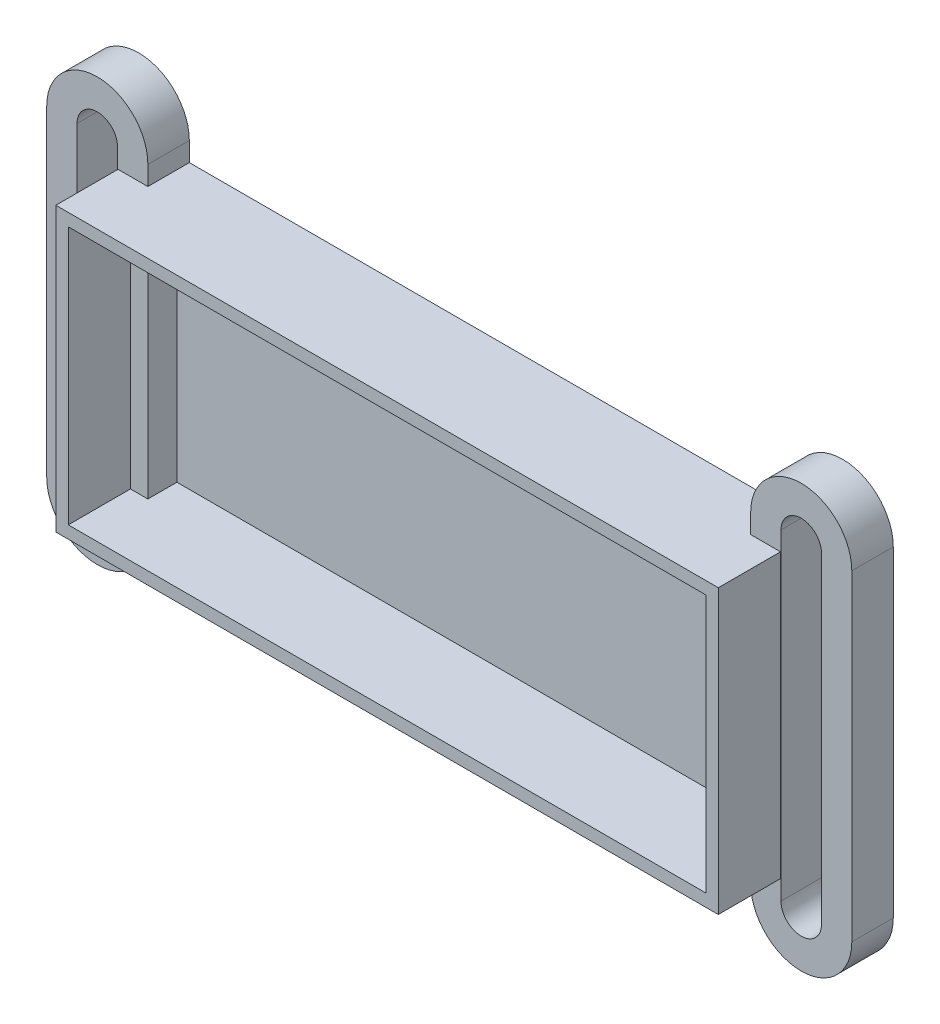
ISO-10303-21;
HEADER;
FILE_DESCRIPTION(('STEP AP214'),'2;1');
FILE_NAME('part.step','',(''),(''),'','','');
FILE_SCHEMA(('AUTOMOTIVE_DESIGN { 1 0 10303 214 1 1 1 1 }'));
ENDSEC;
DATA;
#1=APPLICATION_CONTEXT('core data for automotive mechanical design processes');
#2=APPLICATION_PROTOCOL_DEFINITION('international standard','automotive_design',2000,#1);
#3=PRODUCT_CONTEXT('',#1,'mechanical');
#4=PRODUCT('Part','Part','',(#3));
#5=PRODUCT_RELATED_PRODUCT_CATEGORY('part','',(#4));
#6=PRODUCT_DEFINITION_FORMATION('','',#4);
#7=PRODUCT_DEFINITION_CONTEXT('part definition',#1,'design');
#8=PRODUCT_DEFINITION('design','',#6,#7);
#9=PRODUCT_DEFINITION_SHAPE('','',#8);
#10=(LENGTH_UNIT() NAMED_UNIT(*) SI_UNIT(.MILLI.,.METRE.));
#11=(NAMED_UNIT(*) PLANE_ANGLE_UNIT() SI_UNIT($,.RADIAN.));
#12=(NAMED_UNIT(*) SI_UNIT($,.STERADIAN.) SOLID_ANGLE_UNIT());
#13=UNCERTAINTY_MEASURE_WITH_UNIT(LENGTH_MEASURE(1.E-05),#10,'distance_accuracy_value','');
#14=(GEOMETRIC_REPRESENTATION_CONTEXT(3) GLOBAL_UNCERTAINTY_ASSIGNED_CONTEXT((#13)) GLOBAL_UNIT_ASSIGNED_CONTEXT((#10,
#11,#12)) REPRESENTATION_CONTEXT('',''));
#15=CARTESIAN_POINT('',(0.,0.,0.));
#16=DIRECTION('',(0.,0.,1.));
#17=DIRECTION('',(1.,0.,0.));
#18=AXIS2_PLACEMENT_3D('',#15,#16,#17);
#19=CARTESIAN_POINT('',(-40.4302838924313,18.8073356452537,0.));
#20=DIRECTION('',(0.,1.,0.));
#21=DIRECTION('',(-1.,0.,0.));
#22=AXIS2_PLACEMENT_3D('',#19,#20,#21);
#23=PLANE('',#22);
#24=DIRECTION('',(0.,0.,-1.));
#25=VECTOR('',#24,1.);
#26=CARTESIAN_POINT('',(19.392541216514,18.8073356452537,0.));
#27=LINE('',#26,#25);
#28=CARTESIAN_POINT('',(19.392541216514,18.8073356452537,4.));
#29=VERTEX_POINT('',#28);
#30=CARTESIAN_POINT('',(19.392541216514,18.8073356452537,1.2));
#31=VERTEX_POINT('',#30);
#32=EDGE_CURVE('E62',#29,#31,#27,.T.);
#33=ORIENTED_EDGE('',*,*,#32,.F.);
#34=DIRECTION('',(-1.,0.,0.));
#35=VECTOR('',#34,1.);
#36=CARTESIAN_POINT('',(-40.4302838924313,18.8073356452537,4.));
#37=LINE('',#36,#35);
#38=CARTESIAN_POINT('',(21.0697161075687,18.8073356452537,4.));
#39=VERTEX_POINT('',#38);
#40=EDGE_CURVE('E66',#39,#29,#37,.T.);
#41=ORIENTED_EDGE('',*,*,#40,.F.);
#42=DIRECTION('',(0.,0.,1.));
#43=VECTOR('',#42,1.);
#44=CARTESIAN_POINT('',(21.0697161075687,18.8073356452537,0.));
#45=LINE('',#44,#43);
#46=CARTESIAN_POINT('',(21.0697161075687,18.8073356452537,10.));
#47=VERTEX_POINT('',#46);
#48=EDGE_CURVE('E47',#39,#47,#45,.T.);
#49=ORIENTED_EDGE('',*,*,#48,.T.);
#50=DIRECTION('',(-1.,0.,0.));
#51=VECTOR('',#50,1.);
#52=CARTESIAN_POINT('',(-40.4302838924313,18.8073356452537,10.));
#53=LINE('',#52,#51);
#54=CARTESIAN_POINT('',(-40.4302838924313,18.8073356452537,10.));
#55=VERTEX_POINT('',#54);
#56=EDGE_CURVE('E480',#47,#55,#53,.T.);
#57=ORIENTED_EDGE('',*,*,#56,.T.);
#58=DIRECTION('',(0.,0.,1.));
#59=VECTOR('',#58,1.);
#60=CARTESIAN_POINT('',(-40.4302838924313,18.8073356452537,0.));
#61=LINE('',#60,#59);
#62=CARTESIAN_POINT('',(-40.4302838924313,18.8073356452537,4.));
#63=VERTEX_POINT('',#62);
#64=EDGE_CURVE('E486',#63,#55,#61,.T.);
#65=ORIENTED_EDGE('',*,*,#64,.F.);
#66=DIRECTION('',(-1.,0.,0.));
#67=VECTOR('',#66,1.);
#68=CARTESIAN_POINT('',(-40.4302838924313,18.8073356452537,4.));
#69=LINE('',#68,#67);
#70=CARTESIAN_POINT('',(-38.7531090013766,18.8073356452537,4.));
#71=VERTEX_POINT('',#70);
#72=EDGE_CURVE('E471',#71,#63,#69,.T.);
#73=ORIENTED_EDGE('',*,*,#72,.F.);
#74=DIRECTION('',(0.,0.,-1.));
#75=VECTOR('',#74,1.);
#76=CARTESIAN_POINT('',(-38.7531090013766,18.8073356452537,0.));
#77=LINE('',#76,#75);
#78=CARTESIAN_POINT('',(-38.7531090013766,18.8073356452537,1.2));
#79=VERTEX_POINT('',#78);
#80=EDGE_CURVE('E447',#71,#79,#77,.T.);
#81=ORIENTED_EDGE('',*,*,#80,.T.);
#82=DIRECTION('',(-1.,0.,0.));
#83=VECTOR('',#82,1.);
#84=CARTESIAN_POINT('',(-40.4302838924313,18.8073356452537,1.2));
#85=LINE('',#84,#83);
#86=EDGE_CURVE('E477',#31,#79,#85,.T.);
#87=ORIENTED_EDGE('',*,*,#86,.F.);
#88=EDGE_LOOP('',(#33,#41,#49,#57,#65,#73,#81,#87));
#89=FACE_BOUND('',#88,.T.);
#90=ADVANCED_FACE('F43',(#89),#23,.F.);
#91=CARTESIAN_POINT('',(21.0697161075687,18.8073356452537,0.));
#92=DIRECTION('',(1.,0.,0.));
#93=DIRECTION('',(0.,0.,-1.));
#94=AXIS2_PLACEMENT_3D('',#91,#92,#93);
#95=PLANE('',#94);
#96=DIRECTION('',(0.,1.,0.));
#97=VECTOR('',#96,1.);
#98=CARTESIAN_POINT('',(21.0697161075687,18.8073356452537,4.));
#99=LINE('',#98,#97);
#100=CARTESIAN_POINT('',(21.0697161075687,-6.09266435474631,4.));
#101=VERTEX_POINT('',#100);
#102=EDGE_CURVE('E349',#101,#39,#99,.T.);
#103=ORIENTED_EDGE('',*,*,#102,.F.);
#104=DIRECTION('',(0.,0.,1.));
#105=VECTOR('',#104,1.);
#106=CARTESIAN_POINT('',(21.0697161075687,-6.09266435474631,0.));
#107=LINE('',#106,#105);
#108=CARTESIAN_POINT('',(21.0697161075687,-6.09266435474631,10.));
#109=VERTEX_POINT('',#108);
#110=EDGE_CURVE('E531',#101,#109,#107,.T.);
#111=ORIENTED_EDGE('',*,*,#110,.T.);
#112=DIRECTION('',(0.,1.,0.));
#113=VECTOR('',#112,1.);
#114=CARTESIAN_POINT('',(21.0697161075687,18.8073356452537,10.));
#115=LINE('',#114,#113);
#116=EDGE_CURVE('E490',#109,#47,#115,.T.);
#117=ORIENTED_EDGE('',*,*,#116,.T.);
#118=ORIENTED_EDGE('',*,*,#48,.F.);
#119=EDGE_LOOP('',(#103,#111,#117,#118));
#120=FACE_BOUND('',#119,.T.);
#121=ADVANCED_FACE('F655',(#120),#95,.F.);
#122=CARTESIAN_POINT('',(-40.4302838924313,-6.09266435474631,0.));
#123=DIRECTION('',(0.,-1.,0.));
#124=DIRECTION('',(0.,0.,-1.));
#125=AXIS2_PLACEMENT_3D('',#122,#123,#124);
#126=PLANE('',#125);
#127=DIRECTION('',(0.,0.,1.));
#128=VECTOR('',#127,1.);
#129=CARTESIAN_POINT('',(19.392541216514,-6.09266435474631,0.));
#130=LINE('',#129,#128);
#131=CARTESIAN_POINT('',(19.392541216514,-6.09266435474631,1.2));
#132=VERTEX_POINT('',#131);
#133=CARTESIAN_POINT('',(19.392541216514,-6.09266435474631,4.));
#134=VERTEX_POINT('',#133);
#135=EDGE_CURVE('E310',#132,#134,#130,.T.);
#136=ORIENTED_EDGE('',*,*,#135,.F.);
#137=DIRECTION('',(1.,0.,0.));
#138=VECTOR('',#137,1.);
#139=CARTESIAN_POINT('',(-40.4302838924313,-6.09266435474631,1.2));
#140=LINE('',#139,#138);
#141=CARTESIAN_POINT('',(-38.7531090013766,-6.09266435474631,1.2));
#142=VERTEX_POINT('',#141);
#143=EDGE_CURVE('E474',#142,#132,#140,.T.);
#144=ORIENTED_EDGE('',*,*,#143,.F.);
#145=DIRECTION('',(0.,0.,1.));
#146=VECTOR('',#145,1.);
#147=CARTESIAN_POINT('',(-38.7531090013766,-6.09266435474631,0.));
#148=LINE('',#147,#146);
#149=CARTESIAN_POINT('',(-38.7531090013766,-6.09266435474631,4.));
#150=VERTEX_POINT('',#149);
#151=EDGE_CURVE('E420',#142,#150,#148,.T.);
#152=ORIENTED_EDGE('',*,*,#151,.T.);
#153=DIRECTION('',(1.,0.,0.));
#154=VECTOR('',#153,1.);
#155=CARTESIAN_POINT('',(-40.4302838924313,-6.09266435474631,4.));
#156=LINE('',#155,#154);
#157=CARTESIAN_POINT('',(-40.4302838924313,-6.09266435474631,4.));
#158=VERTEX_POINT('',#157);
#159=EDGE_CURVE('E468',#158,#150,#156,.T.);
#160=ORIENTED_EDGE('',*,*,#159,.F.);
#161=DIRECTION('',(0.,0.,1.));
#162=VECTOR('',#161,1.);
#163=CARTESIAN_POINT('',(-40.4302838924313,-6.09266435474631,0.));
#164=LINE('',#163,#162);
#165=CARTESIAN_POINT('',(-40.4302838924313,-6.09266435474631,10.));
#166=VERTEX_POINT('',#165);
#167=EDGE_CURVE('E494',#158,#166,#164,.T.);
#168=ORIENTED_EDGE('',*,*,#167,.T.);
#169=DIRECTION('',(1.,0.,0.));
#170=VECTOR('',#169,1.);
#171=CARTESIAN_POINT('',(-40.4302838924313,-6.09266435474631,10.));
#172=LINE('',#171,#170);
#173=EDGE_CURVE('E498',#166,#109,#172,.T.);
#174=ORIENTED_EDGE('',*,*,#173,.T.);
#175=ORIENTED_EDGE('',*,*,#110,.F.);
#176=DIRECTION('',(1.,0.,0.));
#177=VECTOR('',#176,1.);
#178=CARTESIAN_POINT('',(-40.4302838924313,-6.09266435474631,4.));
#179=LINE('',#178,#177);
#180=EDGE_CURVE('E345',#134,#101,#179,.T.);
#181=ORIENTED_EDGE('',*,*,#180,.F.);
#182=EDGE_LOOP('',(#136,#144,#152,#160,#168,#174,#175,#181));
#183=FACE_BOUND('',#182,.T.);
#184=ADVANCED_FACE('F660',(#183),#126,.F.);
#185=CARTESIAN_POINT('',(-41.6302838924313,20.0073356452537,0.));
#186=DIRECTION('',(0.,1.,0.));
#187=DIRECTION('',(0.,0.,1.));
#188=AXIS2_PLACEMENT_3D('',#185,#186,#187);
#189=PLANE('',#188);
#190=DIRECTION('',(-1.,0.,0.));
#191=VECTOR('',#190,1.);
#192=CARTESIAN_POINT('',(-41.6302838924313,20.0073356452537,4.));
#193=LINE('',#192,#191);
#194=CARTESIAN_POINT('',(22.2697161075687,20.0073356452537,4.));
#195=VERTEX_POINT('',#194);
#196=CARTESIAN_POINT('',(19.392541216514,20.0073356452537,4.));
#197=VERTEX_POINT('',#196);
#198=EDGE_CURVE('E342',#195,#197,#193,.T.);
#199=ORIENTED_EDGE('',*,*,#198,.T.);
#200=DIRECTION('',(0.,0.,-1.));
#201=VECTOR('',#200,1.);
#202=CARTESIAN_POINT('',(19.392541216514,20.0073356452537,0.));
#203=LINE('',#202,#201);
#204=CARTESIAN_POINT('',(19.392541216514,20.0073356452537,0.));
#205=VERTEX_POINT('',#204);
#206=EDGE_CURVE('E281',#197,#205,#203,.T.);
#207=ORIENTED_EDGE('',*,*,#206,.T.);
#208=DIRECTION('',(-1.,0.,0.));
#209=VECTOR('',#208,1.);
#210=CARTESIAN_POINT('',(-41.6302838924313,20.0073356452537,0.));
#211=LINE('',#210,#209);
#212=CARTESIAN_POINT('',(-38.7531090013766,20.0073356452537,0.));
#213=VERTEX_POINT('',#212);
#214=EDGE_CURVE('E527',#205,#213,#211,.T.);
#215=ORIENTED_EDGE('',*,*,#214,.T.);
#216=DIRECTION('',(0.,0.,-1.));
#217=VECTOR('',#216,1.);
#218=CARTESIAN_POINT('',(-38.7531090013766,20.0073356452537,0.));
#219=LINE('',#218,#217);
#220=CARTESIAN_POINT('',(-38.7531090013766,20.0073356452537,4.));
#221=VERTEX_POINT('',#220);
#222=EDGE_CURVE('E455',#221,#213,#219,.T.);
#223=ORIENTED_EDGE('',*,*,#222,.F.);
#224=DIRECTION('',(-1.,0.,0.));
#225=VECTOR('',#224,1.);
#226=CARTESIAN_POINT('',(-41.6302838924313,20.0073356452537,4.));
#227=LINE('',#226,#225);
#228=CARTESIAN_POINT('',(-41.6302838924313,20.0073356452537,4.));
#229=VERTEX_POINT('',#228);
#230=EDGE_CURVE('E462',#221,#229,#227,.T.);
#231=ORIENTED_EDGE('',*,*,#230,.T.);
#232=DIRECTION('',(0.,0.,1.));
#233=VECTOR('',#232,1.);
#234=CARTESIAN_POINT('',(-41.6302838924313,20.0073356452537,0.));
#235=LINE('',#234,#233);
#236=CARTESIAN_POINT('',(-41.6302838924313,20.0073356452537,10.));
#237=VERTEX_POINT('',#236);
#238=EDGE_CURVE('E517',#229,#237,#235,.T.);
#239=ORIENTED_EDGE('',*,*,#238,.T.);
#240=DIRECTION('',(-1.,0.,0.));
#241=VECTOR('',#240,1.);
#242=CARTESIAN_POINT('',(-41.6302838924313,20.0073356452537,10.));
#243=LINE('',#242,#241);
#244=CARTESIAN_POINT('',(22.2697161075687,20.0073356452537,10.));
#245=VERTEX_POINT('',#244);
#246=EDGE_CURVE('E528',#245,#237,#243,.T.);
#247=ORIENTED_EDGE('',*,*,#246,.F.);
#248=DIRECTION('',(0.,0.,1.));
#249=VECTOR('',#248,1.);
#250=CARTESIAN_POINT('',(22.2697161075687,20.0073356452537,0.));
#251=LINE('',#250,#249);
#252=EDGE_CURVE('E524',#195,#245,#251,.T.);
#253=ORIENTED_EDGE('',*,*,#252,.F.);
#254=EDGE_LOOP('',(#199,#207,#215,#223,#231,#239,#247,#253));
#255=FACE_BOUND('',#254,.T.);
#256=ADVANCED_FACE('F578',(#255),#189,.T.);
#257=CARTESIAN_POINT('',(22.2697161075687,20.0073356452537,0.));
#258=DIRECTION('',(1.,0.,0.));
#259=DIRECTION('',(0.,0.,-1.));
#260=AXIS2_PLACEMENT_3D('',#257,#258,#259);
#261=PLANE('',#260);
#262=DIRECTION('',(0.,0.,1.));
#263=VECTOR('',#262,1.);
#264=CARTESIAN_POINT('',(22.2697161075687,-7.29266435474631,0.));
#265=LINE('',#264,#263);
#266=CARTESIAN_POINT('',(22.2697161075687,-7.29266435474631,4.));
#267=VERTEX_POINT('',#266);
#268=CARTESIAN_POINT('',(22.2697161075687,-7.29266435474631,10.));
#269=VERTEX_POINT('',#268);
#270=EDGE_CURVE('E503',#267,#269,#265,.T.);
#271=ORIENTED_EDGE('',*,*,#270,.F.);
#272=DIRECTION('',(0.,1.,0.));
#273=VECTOR('',#272,1.);
#274=CARTESIAN_POINT('',(22.2697161075687,20.0073356452537,4.));
#275=LINE('',#274,#273);
#276=EDGE_CURVE('E339',#267,#195,#275,.T.);
#277=ORIENTED_EDGE('',*,*,#276,.T.);
#278=ORIENTED_EDGE('',*,*,#252,.T.);
#279=DIRECTION('',(0.,1.,0.));
#280=VECTOR('',#279,1.);
#281=CARTESIAN_POINT('',(22.2697161075687,20.0073356452537,10.));
#282=LINE('',#281,#280);
#283=EDGE_CURVE('E507',#269,#245,#282,.T.);
#284=ORIENTED_EDGE('',*,*,#283,.F.);
#285=EDGE_LOOP('',(#271,#277,#278,#284));
#286=FACE_BOUND('',#285,.T.);
#287=ADVANCED_FACE('F574',(#286),#261,.T.);
#288=CARTESIAN_POINT('',(-41.6302838924313,-7.29266435474631,0.));
#289=DIRECTION('',(0.,-1.,0.));
#290=DIRECTION('',(0.,0.,-1.));
#291=AXIS2_PLACEMENT_3D('',#288,#289,#290);
#292=PLANE('',#291);
#293=DIRECTION('',(1.,0.,0.));
#294=VECTOR('',#293,1.);
#295=CARTESIAN_POINT('',(-41.6302838924313,-7.29266435474631,0.));
#296=LINE('',#295,#294);
#297=CARTESIAN_POINT('',(-38.7531090013766,-7.29266435474631,0.));
#298=VERTEX_POINT('',#297);
#299=CARTESIAN_POINT('',(19.392541216514,-7.29266435474631,0.));
#300=VERTEX_POINT('',#299);
#301=EDGE_CURVE('E491',#298,#300,#296,.T.);
#302=ORIENTED_EDGE('',*,*,#301,.T.);
#303=DIRECTION('',(0.,0.,1.));
#304=VECTOR('',#303,1.);
#305=CARTESIAN_POINT('',(19.392541216514,-7.29266435474631,0.));
#306=LINE('',#305,#304);
#307=CARTESIAN_POINT('',(19.392541216514,-7.29266435474631,4.));
#308=VERTEX_POINT('',#307);
#309=EDGE_CURVE('E334',#300,#308,#306,.T.);
#310=ORIENTED_EDGE('',*,*,#309,.T.);
#311=DIRECTION('',(1.,0.,0.));
#312=VECTOR('',#311,1.);
#313=CARTESIAN_POINT('',(-41.6302838924313,-7.29266435474631,4.));
#314=LINE('',#313,#312);
#315=EDGE_CURVE('E12',#308,#267,#314,.T.);
#316=ORIENTED_EDGE('',*,*,#315,.T.);
#317=ORIENTED_EDGE('',*,*,#270,.T.);
#318=DIRECTION('',(1.,0.,0.));
#319=VECTOR('',#318,1.);
#320=CARTESIAN_POINT('',(-41.6302838924313,-7.29266435474631,10.));
#321=LINE('',#320,#319);
#322=CARTESIAN_POINT('',(-41.6302838924313,-7.29266435474631,10.));
#323=VERTEX_POINT('',#322);
#324=EDGE_CURVE('E506',#323,#269,#321,.T.);
#325=ORIENTED_EDGE('',*,*,#324,.F.);
#326=DIRECTION('',(0.,0.,1.));
#327=VECTOR('',#326,1.);
#328=CARTESIAN_POINT('',(-41.6302838924313,-7.29266435474631,0.));
#329=LINE('',#328,#327);
#330=CARTESIAN_POINT('',(-41.6302838924313,-7.29266435474631,4.));
#331=VERTEX_POINT('',#330);
#332=EDGE_CURVE('E540',#331,#323,#329,.T.);
#333=ORIENTED_EDGE('',*,*,#332,.F.);
#334=DIRECTION('',(1.,0.,0.));
#335=VECTOR('',#334,1.);
#336=CARTESIAN_POINT('',(-41.6302838924313,-7.29266435474631,4.));
#337=LINE('',#336,#335);
#338=CARTESIAN_POINT('',(-38.7531090013766,-7.29266435474631,4.));
#339=VERTEX_POINT('',#338);
#340=EDGE_CURVE('E459',#331,#339,#337,.T.);
#341=ORIENTED_EDGE('',*,*,#340,.T.);
#342=DIRECTION('',(0.,0.,1.));
#343=VECTOR('',#342,1.);
#344=CARTESIAN_POINT('',(-38.7531090013766,-7.29266435474631,0.));
#345=LINE('',#344,#343);
#346=EDGE_CURVE('E451',#298,#339,#345,.T.);
#347=ORIENTED_EDGE('',*,*,#346,.F.);
#348=EDGE_LOOP('',(#302,#310,#316,#317,#325,#333,#341,#347));
#349=FACE_BOUND('',#348,.T.);
#350=ADVANCED_FACE('F679',(#349),#292,.T.);
#351=CARTESIAN_POINT('',(0.,0.,1.2));
#352=DIRECTION('',(0.,0.,-1.));
#353=DIRECTION('',(-1.,0.,0.));
#354=AXIS2_PLACEMENT_3D('',#351,#352,#353);
#355=PLANE('',#354);
#356=DIRECTION('',(0.,-1.,0.));
#357=VECTOR('',#356,1.);
#358=CARTESIAN_POINT('',(19.392541216514,0.,1.2));
#359=LINE('',#358,#357);
#360=EDGE_CURVE('E54',#31,#132,#359,.T.);
#361=ORIENTED_EDGE('',*,*,#360,.F.);
#362=ORIENTED_EDGE('',*,*,#86,.T.);
#363=DIRECTION('',(0.,-1.,0.));
#364=VECTOR('',#363,1.);
#365=CARTESIAN_POINT('',(-38.7531090013766,0.,1.2));
#366=LINE('',#365,#364);
#367=EDGE_CURVE('E522',#79,#142,#366,.T.);
#368=ORIENTED_EDGE('',*,*,#367,.T.);
#369=ORIENTED_EDGE('',*,*,#143,.T.);
#370=EDGE_LOOP('',(#361,#362,#368,#369));
#371=FACE_BOUND('',#370,.T.);
#372=ADVANCED_FACE('F664',(#371),#355,.F.);
#373=CARTESIAN_POINT('',(-40.4302838924313,18.8073356452537,0.));
#374=DIRECTION('',(-1.,0.,0.));
#375=DIRECTION('',(0.,0.,1.));
#376=AXIS2_PLACEMENT_3D('',#373,#374,#375);
#377=PLANE('',#376);
#378=DIRECTION('',(0.,-1.,0.));
#379=VECTOR('',#378,1.);
#380=CARTESIAN_POINT('',(-40.4302838924313,18.8073356452537,4.));
#381=LINE('',#380,#379);
#382=EDGE_CURVE('E465',#63,#158,#381,.T.);
#383=ORIENTED_EDGE('',*,*,#382,.F.);
#384=ORIENTED_EDGE('',*,*,#64,.T.);
#385=DIRECTION('',(0.,-1.,0.));
#386=VECTOR('',#385,1.);
#387=CARTESIAN_POINT('',(-40.4302838924313,18.8073356452537,10.));
#388=LINE('',#387,#386);
#389=EDGE_CURVE('E497',#55,#166,#388,.T.);
#390=ORIENTED_EDGE('',*,*,#389,.T.);
#391=ORIENTED_EDGE('',*,*,#167,.F.);
#392=EDGE_LOOP('',(#383,#384,#390,#391));
#393=FACE_BOUND('',#392,.T.);
#394=ADVANCED_FACE('F670',(#393),#377,.F.);
#395=CARTESIAN_POINT('',(-41.6302838924313,20.0073356452537,0.));
#396=DIRECTION('',(-1.,0.,0.));
#397=DIRECTION('',(0.,0.,1.));
#398=AXIS2_PLACEMENT_3D('',#395,#396,#397);
#399=PLANE('',#398);
#400=ORIENTED_EDGE('',*,*,#238,.F.);
#401=DIRECTION('',(0.,-1.,0.));
#402=VECTOR('',#401,1.);
#403=CARTESIAN_POINT('',(-41.6302838924313,20.0073356452537,4.));
#404=LINE('',#403,#402);
#405=EDGE_CURVE('E502',#229,#331,#404,.T.);
#406=ORIENTED_EDGE('',*,*,#405,.T.);
#407=ORIENTED_EDGE('',*,*,#332,.T.);
#408=DIRECTION('',(0.,-1.,0.));
#409=VECTOR('',#408,1.);
#410=CARTESIAN_POINT('',(-41.6302838924313,20.0073356452537,10.));
#411=LINE('',#410,#409);
#412=EDGE_CURVE('E551',#237,#323,#411,.T.);
#413=ORIENTED_EDGE('',*,*,#412,.F.);
#414=EDGE_LOOP('',(#400,#406,#407,#413));
#415=FACE_BOUND('',#414,.T.);
#416=ADVANCED_FACE('F673',(#415),#399,.T.);
#417=CARTESIAN_POINT('',(0.,0.,10.));
#418=DIRECTION('',(0.,0.,1.));
#419=DIRECTION('',(1.,0.,0.));
#420=AXIS2_PLACEMENT_3D('',#417,#418,#419);
#421=PLANE('',#420);
#422=ORIENTED_EDGE('',*,*,#56,.F.);
#423=ORIENTED_EDGE('',*,*,#116,.F.);
#424=ORIENTED_EDGE('',*,*,#173,.F.);
#425=ORIENTED_EDGE('',*,*,#389,.F.);
#426=EDGE_LOOP('',(#422,#423,#424,#425));
#427=FACE_BOUND('',#426,.T.);
#428=ORIENTED_EDGE('',*,*,#246,.T.);
#429=ORIENTED_EDGE('',*,*,#412,.T.);
#430=ORIENTED_EDGE('',*,*,#324,.T.);
#431=ORIENTED_EDGE('',*,*,#283,.T.);
#432=EDGE_LOOP('',(#428,#429,#430,#431));
#433=FACE_BOUND('',#432,.T.);
#434=ADVANCED_FACE('F45',(#427,#433),#421,.T.);
#435=CARTESIAN_POINT('',(0.,0.,0.));
#436=DIRECTION('',(0.,0.,1.));
#437=DIRECTION('',(1.,0.,0.));
#438=AXIS2_PLACEMENT_3D('',#435,#436,#437);
#439=PLANE('',#438);
#440=DIRECTION('',(0.,-1.,0.));
#441=VECTOR('',#440,1.);
#442=CARTESIAN_POINT('',(19.392541216514,0.,0.));
#443=LINE('',#442,#441);
#444=CARTESIAN_POINT('',(19.392541216514,-9.14266435474631,0.));
#445=VERTEX_POINT('',#444);
#446=EDGE_CURVE('E584',#300,#445,#443,.T.);
#447=ORIENTED_EDGE('',*,*,#446,.F.);
#448=ORIENTED_EDGE('',*,*,#301,.F.);
#449=DIRECTION('',(0.,-1.,0.));
#450=VECTOR('',#449,1.);
#451=CARTESIAN_POINT('',(-38.7531090013766,0.,0.));
#452=LINE('',#451,#450);
#453=CARTESIAN_POINT('',(-38.7531090013766,-9.14266435474631,0.));
#454=VERTEX_POINT('',#453);
#455=EDGE_CURVE('E355',#298,#454,#452,.T.);
#456=ORIENTED_EDGE('',*,*,#455,.T.);
#457=CARTESIAN_POINT('',(-43.6302838924313,-9.14266435474631,0.));
#458=DIRECTION('',(0.,0.,-1.));
#459=DIRECTION('',(-1.,0.,0.));
#460=AXIS2_PLACEMENT_3D('',#457,#458,#459);
#461=CIRCLE('',#460,4.87717489105469);
#462=CARTESIAN_POINT('',(-48.507458783486,-9.14266435474631,0.));
#463=VERTEX_POINT('',#462);
#464=EDGE_CURVE('E391',#454,#463,#461,.T.);
#465=ORIENTED_EDGE('',*,*,#464,.T.);
#466=DIRECTION('',(0.,-1.,0.));
#467=VECTOR('',#466,1.);
#468=CARTESIAN_POINT('',(-48.507458783486,0.,0.));
#469=LINE('',#468,#467);
#470=CARTESIAN_POINT('',(-48.507458783486,21.8573356452537,0.));
#471=VERTEX_POINT('',#470);
#472=EDGE_CURVE('E395',#471,#463,#469,.T.);
#473=ORIENTED_EDGE('',*,*,#472,.F.);
#474=CARTESIAN_POINT('',(-43.6302838924313,21.8573356452537,0.));
#475=DIRECTION('',(0.,0.,-1.));
#476=DIRECTION('',(-1.,0.,0.));
#477=AXIS2_PLACEMENT_3D('',#474,#475,#476);
#478=CIRCLE('',#477,4.87717489105469);
#479=CARTESIAN_POINT('',(-38.7531090013766,21.8573356452537,0.));
#480=VERTEX_POINT('',#479);
#481=EDGE_CURVE('E399',#471,#480,#478,.T.);
#482=ORIENTED_EDGE('',*,*,#481,.T.);
#483=EDGE_CURVE('E387',#480,#213,#452,.T.);
#484=ORIENTED_EDGE('',*,*,#483,.T.);
#485=ORIENTED_EDGE('',*,*,#214,.F.);
#486=CARTESIAN_POINT('',(19.392541216514,21.8573356452537,0.));
#487=VERTEX_POINT('',#486);
#488=EDGE_CURVE('E612',#487,#205,#443,.T.);
#489=ORIENTED_EDGE('',*,*,#488,.F.);
#490=CARTESIAN_POINT('',(24.2697161075687,21.8573356452537,0.));
#491=DIRECTION('',(0.,0.,-1.));
#492=DIRECTION('',(-1.,0.,0.));
#493=AXIS2_PLACEMENT_3D('',#490,#491,#492);
#494=CIRCLE('',#493,4.87717489105469);
#495=CARTESIAN_POINT('',(29.1468909986234,21.8573356452537,0.));
#496=VERTEX_POINT('',#495);
#497=EDGE_CURVE('E271',#496,#487,#494,.F.);
#498=ORIENTED_EDGE('',*,*,#497,.F.);
#499=DIRECTION('',(0.,-1.,0.));
#500=VECTOR('',#499,1.);
#501=CARTESIAN_POINT('',(29.1468909986234,0.,0.));
#502=LINE('',#501,#500);
#503=CARTESIAN_POINT('',(29.1468909986234,-9.14266435474631,0.));
#504=VERTEX_POINT('',#503);
#505=EDGE_CURVE('E617',#496,#504,#502,.T.);
#506=ORIENTED_EDGE('',*,*,#505,.T.);
#507=CARTESIAN_POINT('',(24.2697161075687,-9.14266435474631,0.));
#508=DIRECTION('',(0.,0.,-1.));
#509=DIRECTION('',(-1.,0.,0.));
#510=AXIS2_PLACEMENT_3D('',#507,#508,#509);
#511=CIRCLE('',#510,4.87717489105469);
#512=EDGE_CURVE('E590',#445,#504,#511,.F.);
#513=ORIENTED_EDGE('',*,*,#512,.F.);
#514=EDGE_LOOP('',(#447,#448,#456,#465,#473,#482,#484,#485,#489,#498,#506,#513));
#515=FACE_BOUND('',#514,.T.);
#516=DIRECTION('',(0.,-1.,0.));
#517=VECTOR('',#516,1.);
#518=CARTESIAN_POINT('',(22.3153247596009,0.,0.));
#519=LINE('',#518,#517);
#520=CARTESIAN_POINT('',(22.3153247596009,21.8573356452537,0.));
#521=VERTEX_POINT('',#520);
#522=CARTESIAN_POINT('',(22.3153247596009,-9.14266435474631,0.));
#523=VERTEX_POINT('',#522);
#524=EDGE_CURVE('E622',#521,#523,#519,.T.);
#525=ORIENTED_EDGE('',*,*,#524,.T.);
#526=CARTESIAN_POINT('',(24.2697161075687,-9.14266435474631,0.));
#527=DIRECTION('',(0.,0.,-1.));
#528=DIRECTION('',(-1.,0.,0.));
#529=AXIS2_PLACEMENT_3D('',#526,#527,#528);
#530=CIRCLE('',#529,1.95439134796774);
#531=CARTESIAN_POINT('',(26.2241074555364,-9.14266435474631,0.));
#532=VERTEX_POINT('',#531);
#533=EDGE_CURVE('E303',#523,#532,#530,.F.);
#534=ORIENTED_EDGE('',*,*,#533,.T.);
#535=DIRECTION('',(0.,-1.,0.));
#536=VECTOR('',#535,1.);
#537=CARTESIAN_POINT('',(26.2241074555364,0.,0.));
#538=LINE('',#537,#536);
#539=CARTESIAN_POINT('',(26.2241074555364,21.8573356452537,0.));
#540=VERTEX_POINT('',#539);
#541=EDGE_CURVE('E295',#540,#532,#538,.T.);
#542=ORIENTED_EDGE('',*,*,#541,.F.);
#543=CARTESIAN_POINT('',(24.2697161075687,21.8573356452537,0.));
#544=DIRECTION('',(0.,0.,-1.));
#545=DIRECTION('',(-1.,0.,0.));
#546=AXIS2_PLACEMENT_3D('',#543,#544,#545);
#547=CIRCLE('',#546,1.95439134796774);
#548=EDGE_CURVE('E289',#540,#521,#547,.F.);
#549=ORIENTED_EDGE('',*,*,#548,.T.);
#550=EDGE_LOOP('',(#525,#534,#542,#549));
#551=FACE_BOUND('',#550,.T.);
#552=CARTESIAN_POINT('',(-43.6302838924313,-9.14266435474631,0.));
#553=DIRECTION('',(0.,0.,-1.));
#554=DIRECTION('',(-1.,0.,0.));
#555=AXIS2_PLACEMENT_3D('',#552,#553,#554);
#556=CIRCLE('',#555,1.95439134796774);
#557=CARTESIAN_POINT('',(-41.6758925444636,-9.14266435474631,0.));
#558=VERTEX_POINT('',#557);
#559=CARTESIAN_POINT('',(-45.5846752403991,-9.14266435474631,0.));
#560=VERTEX_POINT('',#559);
#561=EDGE_CURVE('E403',#558,#560,#556,.T.);
#562=ORIENTED_EDGE('',*,*,#561,.F.);
#563=DIRECTION('',(0.,-1.,0.));
#564=VECTOR('',#563,1.);
#565=CARTESIAN_POINT('',(-41.6758925444636,0.,0.));
#566=LINE('',#565,#564);
#567=CARTESIAN_POINT('',(-41.6758925444636,21.8573356452537,0.));
#568=VERTEX_POINT('',#567);
#569=EDGE_CURVE('E407',#568,#558,#566,.T.);
#570=ORIENTED_EDGE('',*,*,#569,.F.);
#571=CARTESIAN_POINT('',(-43.6302838924313,21.8573356452537,0.));
#572=DIRECTION('',(0.,0.,-1.));
#573=DIRECTION('',(-1.,0.,0.));
#574=AXIS2_PLACEMENT_3D('',#571,#572,#573);
#575=CIRCLE('',#574,1.95439134796774);
#576=CARTESIAN_POINT('',(-45.5846752403991,21.8573356452537,0.));
#577=VERTEX_POINT('',#576);
#578=EDGE_CURVE('E410',#577,#568,#575,.T.);
#579=ORIENTED_EDGE('',*,*,#578,.F.);
#580=DIRECTION('',(0.,-1.,0.));
#581=VECTOR('',#580,1.);
#582=CARTESIAN_POINT('',(-45.5846752403991,0.,0.));
#583=LINE('',#582,#581);
#584=EDGE_CURVE('E413',#577,#560,#583,.T.);
#585=ORIENTED_EDGE('',*,*,#584,.T.);
#586=EDGE_LOOP('',(#562,#570,#579,#585));
#587=FACE_BOUND('',#586,.T.);
#588=ADVANCED_FACE('F627',(#515,#551,#587),#439,.F.);
#589=CARTESIAN_POINT('',(-38.7531090013766,0.,4.));
#590=DIRECTION('',(1.,0.,0.));
#591=DIRECTION('',(0.,0.,-1.));
#592=AXIS2_PLACEMENT_3D('',#589,#590,#591);
#593=PLANE('',#592);
#594=ORIENTED_EDGE('',*,*,#80,.F.);
#595=DIRECTION('',(0.,-1.,0.));
#596=VECTOR('',#595,1.);
#597=CARTESIAN_POINT('',(-38.7531090013766,0.,4.));
#598=LINE('',#597,#596);
#599=EDGE_CURVE('E361',#71,#150,#598,.T.);
#600=ORIENTED_EDGE('',*,*,#599,.T.);
#601=ORIENTED_EDGE('',*,*,#151,.F.);
#602=ORIENTED_EDGE('',*,*,#367,.F.);
#603=EDGE_LOOP('',(#594,#600,#601,#602));
#604=FACE_BOUND('',#603,.T.);
#605=ADVANCED_FACE('F684',(#604),#593,.T.);
#606=CARTESIAN_POINT('',(0.,0.,4.));
#607=DIRECTION('',(0.,0.,-1.));
#608=DIRECTION('',(-1.,0.,0.));
#609=AXIS2_PLACEMENT_3D('',#606,#607,#608);
#610=PLANE('',#609);
#611=ORIENTED_EDGE('',*,*,#599,.F.);
#612=ORIENTED_EDGE('',*,*,#72,.T.);
#613=ORIENTED_EDGE('',*,*,#382,.T.);
#614=ORIENTED_EDGE('',*,*,#159,.T.);
#615=EDGE_LOOP('',(#611,#612,#613,#614));
#616=FACE_BOUND('',#615,.T.);
#617=ADVANCED_FACE('F690',(#616),#610,.F.);
#618=CARTESIAN_POINT('',(-38.7531090013766,21.8573356452537,4.));
#619=VERTEX_POINT('',#618);
#620=EDGE_CURVE('E356',#619,#221,#598,.T.);
#621=ORIENTED_EDGE('',*,*,#620,.T.);
#622=ORIENTED_EDGE('',*,*,#222,.T.);
#623=ORIENTED_EDGE('',*,*,#483,.F.);
#624=DIRECTION('',(0.,0.,-1.));
#625=VECTOR('',#624,1.);
#626=CARTESIAN_POINT('',(-38.7531090013766,21.8573356452537,4.));
#627=LINE('',#626,#625);
#628=EDGE_CURVE('E432',#619,#480,#627,.T.);
#629=ORIENTED_EDGE('',*,*,#628,.F.);
#630=EDGE_LOOP('',(#621,#622,#623,#629));
#631=FACE_BOUND('',#630,.T.);
#632=ADVANCED_FACE('F693',(#631),#593,.T.);
#633=CARTESIAN_POINT('',(-43.6302838924313,-9.14266435474631,4.));
#634=DIRECTION('',(0.,0.,-1.));
#635=DIRECTION('',(-1.,0.,0.));
#636=AXIS2_PLACEMENT_3D('',#633,#634,#635);
#637=CYLINDRICAL_SURFACE('',#636,1.95439134796774);
#638=ORIENTED_EDGE('',*,*,#561,.T.);
#639=DIRECTION('',(0.,0.,-1.));
#640=VECTOR('',#639,1.);
#641=CARTESIAN_POINT('',(-45.5846752403991,-9.14266435474631,4.));
#642=LINE('',#641,#640);
#643=CARTESIAN_POINT('',(-45.5846752403991,-9.14266435474631,4.));
#644=VERTEX_POINT('',#643);
#645=EDGE_CURVE('E417',#644,#560,#642,.T.);
#646=ORIENTED_EDGE('',*,*,#645,.F.);
#647=CARTESIAN_POINT('',(-43.6302838924313,-9.14266435474631,4.));
#648=DIRECTION('',(0.,0.,-1.));
#649=DIRECTION('',(-1.,0.,0.));
#650=AXIS2_PLACEMENT_3D('',#647,#648,#649);
#651=CIRCLE('',#650,1.95439134796774);
#652=CARTESIAN_POINT('',(-41.6758925444636,-9.14266435474631,4.));
#653=VERTEX_POINT('',#652);
#654=EDGE_CURVE('E373',#653,#644,#651,.T.);
#655=ORIENTED_EDGE('',*,*,#654,.F.);
#656=DIRECTION('',(0.,0.,-1.));
#657=VECTOR('',#656,1.);
#658=CARTESIAN_POINT('',(-41.6758925444636,-9.14266435474631,4.));
#659=LINE('',#658,#657);
#660=EDGE_CURVE('E428',#653,#558,#659,.T.);
#661=ORIENTED_EDGE('',*,*,#660,.T.);
#662=EDGE_LOOP('',(#638,#646,#655,#661));
#663=FACE_BOUND('',#662,.T.);
#664=ADVANCED_FACE('F722',(#663),#637,.F.);
#665=CARTESIAN_POINT('',(-45.5846752403991,0.,4.));
#666=DIRECTION('',(1.,0.,0.));
#667=DIRECTION('',(0.,0.,-1.));
#668=AXIS2_PLACEMENT_3D('',#665,#666,#667);
#669=PLANE('',#668);
#670=ORIENTED_EDGE('',*,*,#584,.F.);
#671=DIRECTION('',(0.,0.,-1.));
#672=VECTOR('',#671,1.);
#673=CARTESIAN_POINT('',(-45.5846752403991,21.8573356452537,4.));
#674=LINE('',#673,#672);
#675=CARTESIAN_POINT('',(-45.5846752403991,21.8573356452537,4.));
#676=VERTEX_POINT('',#675);
#677=EDGE_CURVE('E421',#676,#577,#674,.T.);
#678=ORIENTED_EDGE('',*,*,#677,.F.);
#679=DIRECTION('',(0.,-1.,0.));
#680=VECTOR('',#679,1.);
#681=CARTESIAN_POINT('',(-45.5846752403991,0.,4.));
#682=LINE('',#681,#680);
#683=EDGE_CURVE('E382',#676,#644,#682,.T.);
#684=ORIENTED_EDGE('',*,*,#683,.T.);
#685=ORIENTED_EDGE('',*,*,#645,.T.);
#686=EDGE_LOOP('',(#670,#678,#684,#685));
#687=FACE_BOUND('',#686,.T.);
#688=ADVANCED_FACE('F718',(#687),#669,.T.);
#689=CARTESIAN_POINT('',(-43.6302838924313,21.8573356452537,4.));
#690=DIRECTION('',(0.,0.,-1.));
#691=DIRECTION('',(-1.,0.,0.));
#692=AXIS2_PLACEMENT_3D('',#689,#690,#691);
#693=CYLINDRICAL_SURFACE('',#692,1.95439134796774);
#694=ORIENTED_EDGE('',*,*,#578,.T.);
#695=DIRECTION('',(0.,0.,-1.));
#696=VECTOR('',#695,1.);
#697=CARTESIAN_POINT('',(-41.6758925444636,21.8573356452537,4.));
#698=LINE('',#697,#696);
#699=CARTESIAN_POINT('',(-41.6758925444636,21.8573356452537,4.));
#700=VERTEX_POINT('',#699);
#701=EDGE_CURVE('E424',#700,#568,#698,.T.);
#702=ORIENTED_EDGE('',*,*,#701,.F.);
#703=CARTESIAN_POINT('',(-43.6302838924313,21.8573356452537,4.));
#704=DIRECTION('',(0.,0.,-1.));
#705=DIRECTION('',(-1.,0.,0.));
#706=AXIS2_PLACEMENT_3D('',#703,#704,#705);
#707=CIRCLE('',#706,1.95439134796774);
#708=EDGE_CURVE('E379',#676,#700,#707,.T.);
#709=ORIENTED_EDGE('',*,*,#708,.F.);
#710=ORIENTED_EDGE('',*,*,#677,.T.);
#711=EDGE_LOOP('',(#694,#702,#709,#710));
#712=FACE_BOUND('',#711,.T.);
#713=ADVANCED_FACE('F721',(#712),#693,.F.);
#714=ORIENTED_EDGE('',*,*,#455,.F.);
#715=ORIENTED_EDGE('',*,*,#346,.T.);
#716=CARTESIAN_POINT('',(-38.7531090013766,-9.14266435474631,4.));
#717=VERTEX_POINT('',#716);
#718=EDGE_CURVE('E362',#339,#717,#598,.T.);
#719=ORIENTED_EDGE('',*,*,#718,.T.);
#720=DIRECTION('',(0.,0.,-1.));
#721=VECTOR('',#720,1.);
#722=CARTESIAN_POINT('',(-38.7531090013766,-9.14266435474631,4.));
#723=LINE('',#722,#721);
#724=EDGE_CURVE('E386',#717,#454,#723,.T.);
#725=ORIENTED_EDGE('',*,*,#724,.T.);
#726=EDGE_LOOP('',(#714,#715,#719,#725));
#727=FACE_BOUND('',#726,.T.);
#728=ADVANCED_FACE('F692',(#727),#593,.T.);
#729=CARTESIAN_POINT('',(-43.6302838924313,21.8573356452537,4.));
#730=DIRECTION('',(0.,0.,-1.));
#731=DIRECTION('',(-1.,0.,0.));
#732=AXIS2_PLACEMENT_3D('',#729,#730,#731);
#733=CYLINDRICAL_SURFACE('',#732,4.87717489105469);
#734=ORIENTED_EDGE('',*,*,#481,.F.);
#735=DIRECTION('',(0.,0.,-1.));
#736=VECTOR('',#735,1.);
#737=CARTESIAN_POINT('',(-48.507458783486,21.8573356452537,4.));
#738=LINE('',#737,#736);
#739=CARTESIAN_POINT('',(-48.507458783486,21.8573356452537,4.));
#740=VERTEX_POINT('',#739);
#741=EDGE_CURVE('E435',#740,#471,#738,.T.);
#742=ORIENTED_EDGE('',*,*,#741,.F.);
#743=CARTESIAN_POINT('',(-43.6302838924313,21.8573356452537,4.));
#744=DIRECTION('',(0.,0.,-1.));
#745=DIRECTION('',(-1.,0.,0.));
#746=AXIS2_PLACEMENT_3D('',#743,#744,#745);
#747=CIRCLE('',#746,4.87717489105469);
#748=EDGE_CURVE('E369',#740,#619,#747,.T.);
#749=ORIENTED_EDGE('',*,*,#748,.T.);
#750=ORIENTED_EDGE('',*,*,#628,.T.);
#751=EDGE_LOOP('',(#734,#742,#749,#750));
#752=FACE_BOUND('',#751,.T.);
#753=ADVANCED_FACE('F734',(#752),#733,.T.);
#754=CARTESIAN_POINT('',(-48.507458783486,0.,4.));
#755=DIRECTION('',(1.,0.,0.));
#756=DIRECTION('',(0.,0.,-1.));
#757=AXIS2_PLACEMENT_3D('',#754,#755,#756);
#758=PLANE('',#757);
#759=ORIENTED_EDGE('',*,*,#472,.T.);
#760=DIRECTION('',(0.,0.,-1.));
#761=VECTOR('',#760,1.);
#762=CARTESIAN_POINT('',(-48.507458783486,-9.14266435474631,4.));
#763=LINE('',#762,#761);
#764=CARTESIAN_POINT('',(-48.507458783486,-9.14266435474631,4.));
#765=VERTEX_POINT('',#764);
#766=EDGE_CURVE('E438',#765,#463,#763,.T.);
#767=ORIENTED_EDGE('',*,*,#766,.F.);
#768=DIRECTION('',(0.,-1.,0.));
#769=VECTOR('',#768,1.);
#770=CARTESIAN_POINT('',(-48.507458783486,0.,4.));
#771=LINE('',#770,#769);
#772=EDGE_CURVE('E366',#740,#765,#771,.T.);
#773=ORIENTED_EDGE('',*,*,#772,.F.);
#774=ORIENTED_EDGE('',*,*,#741,.T.);
#775=EDGE_LOOP('',(#759,#767,#773,#774));
#776=FACE_BOUND('',#775,.T.);
#777=ADVANCED_FACE('F737',(#776),#758,.F.);
#778=CARTESIAN_POINT('',(-43.6302838924313,-9.14266435474631,4.));
#779=DIRECTION('',(0.,0.,-1.));
#780=DIRECTION('',(-1.,0.,0.));
#781=AXIS2_PLACEMENT_3D('',#778,#779,#780);
#782=CYLINDRICAL_SURFACE('',#781,4.87717489105469);
#783=ORIENTED_EDGE('',*,*,#464,.F.);
#784=ORIENTED_EDGE('',*,*,#724,.F.);
#785=CARTESIAN_POINT('',(-43.6302838924313,-9.14266435474631,4.));
#786=DIRECTION('',(0.,0.,-1.));
#787=DIRECTION('',(-1.,0.,0.));
#788=AXIS2_PLACEMENT_3D('',#785,#786,#787);
#789=CIRCLE('',#788,4.87717489105469);
#790=EDGE_CURVE('E360',#717,#765,#789,.T.);
#791=ORIENTED_EDGE('',*,*,#790,.T.);
#792=ORIENTED_EDGE('',*,*,#766,.T.);
#793=EDGE_LOOP('',(#783,#784,#791,#792));
#794=FACE_BOUND('',#793,.T.);
#795=ADVANCED_FACE('F729',(#794),#782,.T.);
#796=CARTESIAN_POINT('',(-41.6758925444636,0.,4.));
#797=DIRECTION('',(1.,0.,0.));
#798=DIRECTION('',(0.,0.,-1.));
#799=AXIS2_PLACEMENT_3D('',#796,#797,#798);
#800=PLANE('',#799);
#801=ORIENTED_EDGE('',*,*,#569,.T.);
#802=ORIENTED_EDGE('',*,*,#660,.F.);
#803=DIRECTION('',(0.,-1.,0.));
#804=VECTOR('',#803,1.);
#805=CARTESIAN_POINT('',(-41.6758925444636,0.,4.));
#806=LINE('',#805,#804);
#807=EDGE_CURVE('E376',#700,#653,#806,.T.);
#808=ORIENTED_EDGE('',*,*,#807,.F.);
#809=ORIENTED_EDGE('',*,*,#701,.T.);
#810=EDGE_LOOP('',(#801,#802,#808,#809));
#811=FACE_BOUND('',#810,.T.);
#812=ADVANCED_FACE('F716',(#811),#800,.F.);
#813=ORIENTED_EDGE('',*,*,#230,.F.);
#814=ORIENTED_EDGE('',*,*,#620,.F.);
#815=ORIENTED_EDGE('',*,*,#748,.F.);
#816=ORIENTED_EDGE('',*,*,#772,.T.);
#817=ORIENTED_EDGE('',*,*,#790,.F.);
#818=ORIENTED_EDGE('',*,*,#718,.F.);
#819=ORIENTED_EDGE('',*,*,#340,.F.);
#820=ORIENTED_EDGE('',*,*,#405,.F.);
#821=EDGE_LOOP('',(#813,#814,#815,#816,#817,#818,#819,#820));
#822=FACE_BOUND('',#821,.T.);
#823=ORIENTED_EDGE('',*,*,#654,.T.);
#824=ORIENTED_EDGE('',*,*,#683,.F.);
#825=ORIENTED_EDGE('',*,*,#708,.T.);
#826=ORIENTED_EDGE('',*,*,#807,.T.);
#827=EDGE_LOOP('',(#823,#824,#825,#826));
#828=FACE_BOUND('',#827,.T.);
#829=ADVANCED_FACE('F713',(#822,#828),#610,.F.);
#830=CARTESIAN_POINT('',(19.392541216514,0.,4.));
#831=DIRECTION('',(1.,0.,0.));
#832=DIRECTION('',(0.,0.,-1.));
#833=AXIS2_PLACEMENT_3D('',#830,#831,#832);
#834=PLANE('',#833);
#835=DIRECTION('',(0.,-1.,0.));
#836=VECTOR('',#835,1.);
#837=CARTESIAN_POINT('',(19.392541216514,0.,4.));
#838=LINE('',#837,#836);
#839=EDGE_CURVE('E283',#29,#134,#838,.T.);
#840=ORIENTED_EDGE('',*,*,#839,.F.);
#841=ORIENTED_EDGE('',*,*,#32,.T.);
#842=ORIENTED_EDGE('',*,*,#360,.T.);
#843=ORIENTED_EDGE('',*,*,#135,.T.);
#844=EDGE_LOOP('',(#840,#841,#842,#843));
#845=FACE_BOUND('',#844,.T.);
#846=ADVANCED_FACE('F652',(#845),#834,.F.);
#847=CARTESIAN_POINT('',(0.,0.,4.));
#848=DIRECTION('',(0.,0.,-1.));
#849=DIRECTION('',(-1.,0.,0.));
#850=AXIS2_PLACEMENT_3D('',#847,#848,#849);
#851=PLANE('',#850);
#852=ORIENTED_EDGE('',*,*,#102,.T.);
#853=ORIENTED_EDGE('',*,*,#40,.T.);
#854=ORIENTED_EDGE('',*,*,#839,.T.);
#855=ORIENTED_EDGE('',*,*,#180,.T.);
#856=EDGE_LOOP('',(#852,#853,#854,#855));
#857=FACE_BOUND('',#856,.T.);
#858=ADVANCED_FACE('F645',(#857),#851,.F.);
#859=ORIENTED_EDGE('',*,*,#206,.F.);
#860=CARTESIAN_POINT('',(19.392541216514,21.8573356452537,4.));
#861=VERTEX_POINT('',#860);
#862=EDGE_CURVE('E261',#861,#197,#838,.T.);
#863=ORIENTED_EDGE('',*,*,#862,.F.);
#864=DIRECTION('',(0.,0.,-1.));
#865=VECTOR('',#864,1.);
#866=CARTESIAN_POINT('',(19.392541216514,21.8573356452537,4.));
#867=LINE('',#866,#865);
#868=EDGE_CURVE('E268',#861,#487,#867,.T.);
#869=ORIENTED_EDGE('',*,*,#868,.T.);
#870=ORIENTED_EDGE('',*,*,#488,.T.);
#871=EDGE_LOOP('',(#859,#863,#869,#870));
#872=FACE_BOUND('',#871,.T.);
#873=ADVANCED_FACE('F280',(#872),#834,.F.);
#874=CARTESIAN_POINT('',(22.3153247596009,0.,4.));
#875=DIRECTION('',(1.,0.,0.));
#876=DIRECTION('',(0.,0.,-1.));
#877=AXIS2_PLACEMENT_3D('',#874,#875,#876);
#878=PLANE('',#877);
#879=ORIENTED_EDGE('',*,*,#524,.F.);
#880=DIRECTION('',(0.,0.,-1.));
#881=VECTOR('',#880,1.);
#882=CARTESIAN_POINT('',(22.3153247596009,21.8573356452537,4.));
#883=LINE('',#882,#881);
#884=CARTESIAN_POINT('',(22.3153247596009,21.8573356452537,4.));
#885=VERTEX_POINT('',#884);
#886=EDGE_CURVE('E307',#885,#521,#883,.T.);
#887=ORIENTED_EDGE('',*,*,#886,.F.);
#888=DIRECTION('',(0.,-1.,0.));
#889=VECTOR('',#888,1.);
#890=CARTESIAN_POINT('',(22.3153247596009,0.,4.));
#891=LINE('',#890,#889);
#892=CARTESIAN_POINT('',(22.3153247596009,-9.14266435474631,4.));
#893=VERTEX_POINT('',#892);
#894=EDGE_CURVE('E594',#885,#893,#891,.T.);
#895=ORIENTED_EDGE('',*,*,#894,.T.);
#896=DIRECTION('',(0.,0.,-1.));
#897=VECTOR('',#896,1.);
#898=CARTESIAN_POINT('',(22.3153247596009,-9.14266435474631,4.));
#899=LINE('',#898,#897);
#900=EDGE_CURVE('E317',#893,#523,#899,.T.);
#901=ORIENTED_EDGE('',*,*,#900,.T.);
#902=EDGE_LOOP('',(#879,#887,#895,#901));
#903=FACE_BOUND('',#902,.T.);
#904=ADVANCED_FACE('F642',(#903),#878,.T.);
#905=CARTESIAN_POINT('',(24.2697161075687,21.8573356452537,4.));
#906=DIRECTION('',(0.,0.,-1.));
#907=DIRECTION('',(-1.,0.,0.));
#908=AXIS2_PLACEMENT_3D('',#905,#906,#907);
#909=CYLINDRICAL_SURFACE('',#908,1.95439134796774);
#910=ORIENTED_EDGE('',*,*,#548,.F.);
#911=DIRECTION('',(0.,0.,-1.));
#912=VECTOR('',#911,1.);
#913=CARTESIAN_POINT('',(26.2241074555364,21.8573356452537,4.));
#914=LINE('',#913,#912);
#915=CARTESIAN_POINT('',(26.2241074555364,21.8573356452537,4.));
#916=VERTEX_POINT('',#915);
#917=EDGE_CURVE('E311',#916,#540,#914,.T.);
#918=ORIENTED_EDGE('',*,*,#917,.F.);
#919=CARTESIAN_POINT('',(24.2697161075687,21.8573356452537,4.));
#920=DIRECTION('',(0.,0.,-1.));
#921=DIRECTION('',(-1.,0.,0.));
#922=AXIS2_PLACEMENT_3D('',#919,#920,#921);
#923=CIRCLE('',#922,1.95439134796774);
#924=EDGE_CURVE('E277',#916,#885,#923,.F.);
#925=ORIENTED_EDGE('',*,*,#924,.T.);
#926=ORIENTED_EDGE('',*,*,#886,.T.);
#927=EDGE_LOOP('',(#910,#918,#925,#926));
#928=FACE_BOUND('',#927,.T.);
#929=ADVANCED_FACE('F639',(#928),#909,.F.);
#930=CARTESIAN_POINT('',(26.2241074555364,0.,4.));
#931=DIRECTION('',(1.,0.,0.));
#932=DIRECTION('',(0.,0.,-1.));
#933=AXIS2_PLACEMENT_3D('',#930,#931,#932);
#934=PLANE('',#933);
#935=ORIENTED_EDGE('',*,*,#541,.T.);
#936=DIRECTION('',(0.,0.,-1.));
#937=VECTOR('',#936,1.);
#938=CARTESIAN_POINT('',(26.2241074555364,-9.14266435474631,4.));
#939=LINE('',#938,#937);
#940=CARTESIAN_POINT('',(26.2241074555364,-9.14266435474631,4.));
#941=VERTEX_POINT('',#940);
#942=EDGE_CURVE('E314',#941,#532,#939,.T.);
#943=ORIENTED_EDGE('',*,*,#942,.F.);
#944=DIRECTION('',(0.,-1.,0.));
#945=VECTOR('',#944,1.);
#946=CARTESIAN_POINT('',(26.2241074555364,0.,4.));
#947=LINE('',#946,#945);
#948=EDGE_CURVE('E606',#916,#941,#947,.T.);
#949=ORIENTED_EDGE('',*,*,#948,.F.);
#950=ORIENTED_EDGE('',*,*,#917,.T.);
#951=EDGE_LOOP('',(#935,#943,#949,#950));
#952=FACE_BOUND('',#951,.T.);
#953=ADVANCED_FACE('F636',(#952),#934,.F.);
#954=ORIENTED_EDGE('',*,*,#309,.F.);
#955=ORIENTED_EDGE('',*,*,#446,.T.);
#956=DIRECTION('',(0.,0.,-1.));
#957=VECTOR('',#956,1.);
#958=CARTESIAN_POINT('',(19.392541216514,-9.14266435474631,4.));
#959=LINE('',#958,#957);
#960=CARTESIAN_POINT('',(19.392541216514,-9.14266435474631,4.));
#961=VERTEX_POINT('',#960);
#962=EDGE_CURVE('E320',#961,#445,#959,.T.);
#963=ORIENTED_EDGE('',*,*,#962,.F.);
#964=EDGE_CURVE('E285',#308,#961,#838,.T.);
#965=ORIENTED_EDGE('',*,*,#964,.F.);
#966=EDGE_LOOP('',(#954,#955,#963,#965));
#967=FACE_BOUND('',#966,.T.);
#968=ADVANCED_FACE('F582',(#967),#834,.F.);
#969=CARTESIAN_POINT('',(24.2697161075687,-9.14266435474631,4.));
#970=DIRECTION('',(0.,0.,-1.));
#971=DIRECTION('',(-1.,0.,0.));
#972=AXIS2_PLACEMENT_3D('',#969,#970,#971);
#973=CYLINDRICAL_SURFACE('',#972,4.87717489105469);
#974=ORIENTED_EDGE('',*,*,#512,.T.);
#975=DIRECTION('',(0.,0.,-1.));
#976=VECTOR('',#975,1.);
#977=CARTESIAN_POINT('',(29.1468909986234,-9.14266435474631,4.));
#978=LINE('',#977,#976);
#979=CARTESIAN_POINT('',(29.1468909986234,-9.14266435474631,4.));
#980=VERTEX_POINT('',#979);
#981=EDGE_CURVE('E324',#980,#504,#978,.T.);
#982=ORIENTED_EDGE('',*,*,#981,.F.);
#983=CARTESIAN_POINT('',(24.2697161075687,-9.14266435474631,4.));
#984=DIRECTION('',(0.,0.,-1.));
#985=DIRECTION('',(-1.,0.,0.));
#986=AXIS2_PLACEMENT_3D('',#983,#984,#985);
#987=CIRCLE('',#986,4.87717489105469);
#988=EDGE_CURVE('E592',#961,#980,#987,.F.);
#989=ORIENTED_EDGE('',*,*,#988,.F.);
#990=ORIENTED_EDGE('',*,*,#962,.T.);
#991=EDGE_LOOP('',(#974,#982,#989,#990));
#992=FACE_BOUND('',#991,.T.);
#993=ADVANCED_FACE('F588',(#992),#973,.T.);
#994=CARTESIAN_POINT('',(29.1468909986234,0.,4.));
#995=DIRECTION('',(1.,0.,0.));
#996=DIRECTION('',(0.,0.,-1.));
#997=AXIS2_PLACEMENT_3D('',#994,#995,#996);
#998=PLANE('',#997);
#999=ORIENTED_EDGE('',*,*,#505,.F.);
#1000=DIRECTION('',(0.,0.,-1.));
#1001=VECTOR('',#1000,1.);
#1002=CARTESIAN_POINT('',(29.1468909986234,21.8573356452537,4.));
#1003=LINE('',#1002,#1001);
#1004=CARTESIAN_POINT('',(29.1468909986234,21.8573356452537,4.));
#1005=VERTEX_POINT('',#1004);
#1006=EDGE_CURVE('E276',#1005,#496,#1003,.T.);
#1007=ORIENTED_EDGE('',*,*,#1006,.F.);
#1008=DIRECTION('',(0.,-1.,0.));
#1009=VECTOR('',#1008,1.);
#1010=CARTESIAN_POINT('',(29.1468909986234,0.,4.));
#1011=LINE('',#1010,#1009);
#1012=EDGE_CURVE('E263',#1005,#980,#1011,.T.);
#1013=ORIENTED_EDGE('',*,*,#1012,.T.);
#1014=ORIENTED_EDGE('',*,*,#981,.T.);
#1015=EDGE_LOOP('',(#999,#1007,#1013,#1014));
#1016=FACE_BOUND('',#1015,.T.);
#1017=ADVANCED_FACE('F700',(#1016),#998,.T.);
#1018=CARTESIAN_POINT('',(24.2697161075687,21.8573356452537,4.));
#1019=DIRECTION('',(0.,0.,-1.));
#1020=DIRECTION('',(-1.,0.,0.));
#1021=AXIS2_PLACEMENT_3D('',#1018,#1019,#1020);
#1022=CYLINDRICAL_SURFACE('',#1021,4.87717489105469);
#1023=ORIENTED_EDGE('',*,*,#497,.T.);
#1024=ORIENTED_EDGE('',*,*,#868,.F.);
#1025=CARTESIAN_POINT('',(24.2697161075687,21.8573356452537,4.));
#1026=DIRECTION('',(0.,0.,-1.));
#1027=DIRECTION('',(-1.,0.,0.));
#1028=AXIS2_PLACEMENT_3D('',#1025,#1026,#1027);
#1029=CIRCLE('',#1028,4.87717489105469);
#1030=EDGE_CURVE('E255',#1005,#861,#1029,.F.);
#1031=ORIENTED_EDGE('',*,*,#1030,.F.);
#1032=ORIENTED_EDGE('',*,*,#1006,.T.);
#1033=EDGE_LOOP('',(#1023,#1024,#1031,#1032));
#1034=FACE_BOUND('',#1033,.T.);
#1035=ADVANCED_FACE('F269',(#1034),#1022,.T.);
#1036=CARTESIAN_POINT('',(24.2697161075687,-9.14266435474631,4.));
#1037=DIRECTION('',(0.,0.,-1.));
#1038=DIRECTION('',(-1.,0.,0.));
#1039=AXIS2_PLACEMENT_3D('',#1036,#1037,#1038);
#1040=CYLINDRICAL_SURFACE('',#1039,1.95439134796774);
#1041=ORIENTED_EDGE('',*,*,#533,.F.);
#1042=ORIENTED_EDGE('',*,*,#900,.F.);
#1043=CARTESIAN_POINT('',(24.2697161075687,-9.14266435474631,4.));
#1044=DIRECTION('',(0.,0.,-1.));
#1045=DIRECTION('',(-1.,0.,0.));
#1046=AXIS2_PLACEMENT_3D('',#1043,#1044,#1045);
#1047=CIRCLE('',#1046,1.95439134796774);
#1048=EDGE_CURVE('E599',#893,#941,#1047,.F.);
#1049=ORIENTED_EDGE('',*,*,#1048,.T.);
#1050=ORIENTED_EDGE('',*,*,#942,.T.);
#1051=EDGE_LOOP('',(#1041,#1042,#1049,#1050));
#1052=FACE_BOUND('',#1051,.T.);
#1053=ADVANCED_FACE('F631',(#1052),#1040,.F.);
#1054=ORIENTED_EDGE('',*,*,#198,.F.);
#1055=ORIENTED_EDGE('',*,*,#276,.F.);
#1056=ORIENTED_EDGE('',*,*,#315,.F.);
#1057=ORIENTED_EDGE('',*,*,#964,.T.);
#1058=ORIENTED_EDGE('',*,*,#988,.T.);
#1059=ORIENTED_EDGE('',*,*,#1012,.F.);
#1060=ORIENTED_EDGE('',*,*,#1030,.T.);
#1061=ORIENTED_EDGE('',*,*,#862,.T.);
#1062=EDGE_LOOP('',(#1054,#1055,#1056,#1057,#1058,#1059,#1060,#1061));
#1063=FACE_BOUND('',#1062,.T.);
#1064=ORIENTED_EDGE('',*,*,#894,.F.);
#1065=ORIENTED_EDGE('',*,*,#924,.F.);
#1066=ORIENTED_EDGE('',*,*,#948,.T.);
#1067=ORIENTED_EDGE('',*,*,#1048,.F.);
#1068=EDGE_LOOP('',(#1064,#1065,#1066,#1067));
#1069=FACE_BOUND('',#1068,.T.);
#1070=ADVANCED_FACE('F258',(#1063,#1069),#851,.F.);
#1071=CLOSED_SHELL('',(#90,#121,#184,#256,#287,#350,#372,#394,#416,#434,#588,#605,#617,#632,
#664,#688,#713,#728,#753,#777,#795,#812,#829,#846,#858,#873,#904,#929,#953,#968,#993,#1017,
#1035,#1053,#1070));
#1072=MANIFOLD_SOLID_BREP('B2',#1071);
#1073=ADVANCED_BREP_SHAPE_REPRESENTATION('',(#18,#1072),#14);
#1074=SHAPE_DEFINITION_REPRESENTATION(#9,#1073);
ENDSEC;
END-ISO-10303-21;
